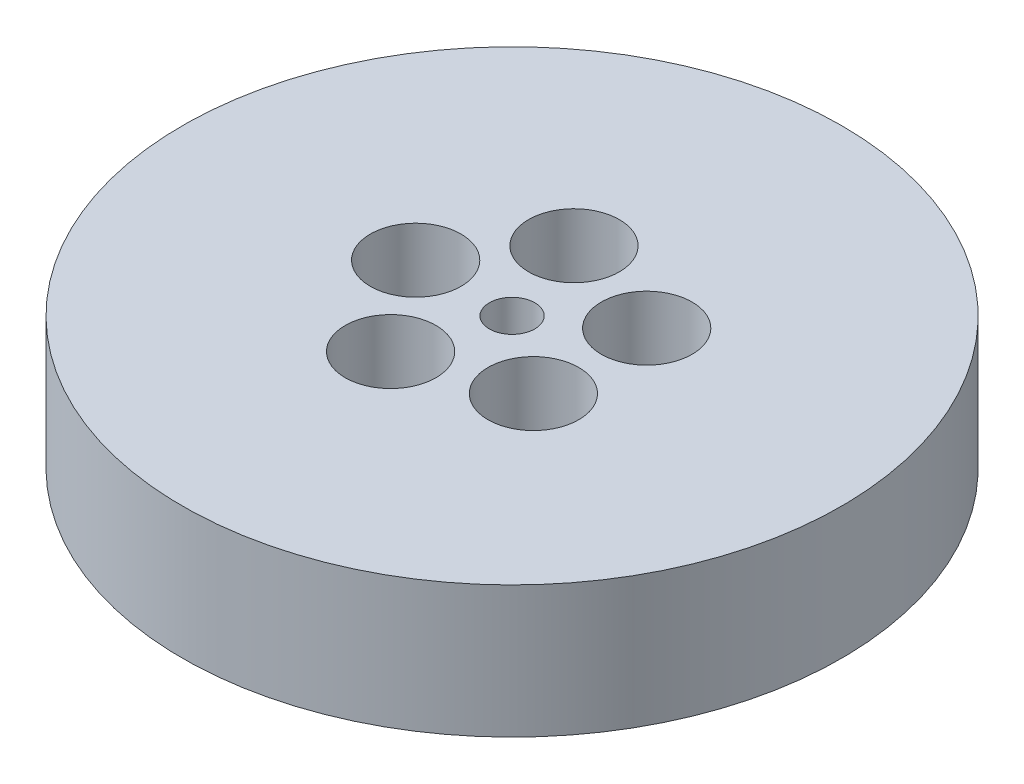
ISO-10303-21;
HEADER;
FILE_DESCRIPTION(('STEP AP214'),'2;1');
FILE_NAME('part.step','',(''),(''),'','','');
FILE_SCHEMA(('AUTOMOTIVE_DESIGN { 1 0 10303 214 1 1 1 1 }'));
ENDSEC;
DATA;
#1=APPLICATION_CONTEXT('core data for automotive mechanical design processes');
#2=APPLICATION_PROTOCOL_DEFINITION('international standard','automotive_design',2000,#1);
#3=PRODUCT_CONTEXT('',#1,'mechanical');
#4=PRODUCT('Part','Part','',(#3));
#5=PRODUCT_RELATED_PRODUCT_CATEGORY('part','',(#4));
#6=PRODUCT_DEFINITION_FORMATION('','',#4);
#7=PRODUCT_DEFINITION_CONTEXT('part definition',#1,'design');
#8=PRODUCT_DEFINITION('design','',#6,#7);
#9=PRODUCT_DEFINITION_SHAPE('','',#8);
#10=(LENGTH_UNIT() NAMED_UNIT(*) SI_UNIT(.MILLI.,.METRE.));
#11=(NAMED_UNIT(*) PLANE_ANGLE_UNIT() SI_UNIT($,.RADIAN.));
#12=(NAMED_UNIT(*) SI_UNIT($,.STERADIAN.) SOLID_ANGLE_UNIT());
#13=UNCERTAINTY_MEASURE_WITH_UNIT(LENGTH_MEASURE(1.E-05),#10,'distance_accuracy_value','');
#14=(GEOMETRIC_REPRESENTATION_CONTEXT(3) GLOBAL_UNCERTAINTY_ASSIGNED_CONTEXT((#13)) GLOBAL_UNIT_ASSIGNED_CONTEXT((#10,
#11,#12)) REPRESENTATION_CONTEXT('',''));
#15=CARTESIAN_POINT('',(0.,0.,0.));
#16=DIRECTION('',(0.,0.,1.));
#17=DIRECTION('',(1.,0.,0.));
#18=AXIS2_PLACEMENT_3D('',#15,#16,#17);
#19=CARTESIAN_POINT('',(0.,29.,0.));
#20=DIRECTION('',(0.,-1.,0.));
#21=DIRECTION('',(0.,0.,-1.));
#22=AXIS2_PLACEMENT_3D('',#19,#20,#21);
#23=CYLINDRICAL_SURFACE('',#22,72.5);
#24=CARTESIAN_POINT('',(0.,29.,0.));
#25=DIRECTION('',(0.,1.,0.));
#26=DIRECTION('',(0.,0.,1.));
#27=AXIS2_PLACEMENT_3D('',#24,#25,#26);
#28=CIRCLE('',#27,72.5);
#29=CARTESIAN_POINT('',(0.,29.,-72.5));
#30=VERTEX_POINT('',#29);
#31=EDGE_CURVE('E10',#30,#30,#28,.T.);
#32=CARTESIAN_POINT('',(0.,0.,0.));
#33=DIRECTION('',(0.,1.,0.));
#34=DIRECTION('',(0.,0.,1.));
#35=AXIS2_PLACEMENT_3D('',#32,#33,#34);
#36=CIRCLE('',#35,72.5);
#37=CARTESIAN_POINT('',(0.,0.,-72.5));
#38=VERTEX_POINT('',#37);
#39=EDGE_CURVE('E37',#38,#38,#36,.T.);
#40=CARTESIAN_POINT('',(0.,29.,-72.5));
#41=CARTESIAN_POINT('',(0.,28.6979166666667,-72.5));
#42=CARTESIAN_POINT('',(0.,28.3958333333333,-72.5));
#43=CARTESIAN_POINT('',(0.,27.7916666666667,-72.5));
#44=CARTESIAN_POINT('',(0.,27.4895833333333,-72.5));
#45=CARTESIAN_POINT('',(0.,26.8854166666667,-72.5));
#46=CARTESIAN_POINT('',(0.,26.5833333333333,-72.5));
#47=CARTESIAN_POINT('',(0.,25.9791666666667,-72.5));
#48=CARTESIAN_POINT('',(0.,25.6770833333333,-72.5));
#49=CARTESIAN_POINT('',(0.,25.0729166666667,-72.5));
#50=CARTESIAN_POINT('',(0.,24.7708333333333,-72.5));
#51=CARTESIAN_POINT('',(0.,24.1666666666667,-72.5));
#52=CARTESIAN_POINT('',(0.,23.8645833333333,-72.5));
#53=CARTESIAN_POINT('',(0.,23.2604166666667,-72.5));
#54=CARTESIAN_POINT('',(0.,22.9583333333333,-72.5));
#55=CARTESIAN_POINT('',(0.,22.3541666666667,-72.5));
#56=CARTESIAN_POINT('',(0.,22.0520833333333,-72.5));
#57=CARTESIAN_POINT('',(0.,21.4479166666667,-72.5));
#58=CARTESIAN_POINT('',(0.,21.1458333333333,-72.5));
#59=CARTESIAN_POINT('',(0.,20.5416666666667,-72.5));
#60=CARTESIAN_POINT('',(0.,20.2395833333333,-72.5));
#61=CARTESIAN_POINT('',(0.,19.6354166666667,-72.5));
#62=CARTESIAN_POINT('',(0.,19.3333333333333,-72.5));
#63=CARTESIAN_POINT('',(0.,18.7291666666667,-72.5));
#64=CARTESIAN_POINT('',(0.,18.4270833333333,-72.5));
#65=CARTESIAN_POINT('',(0.,17.8229166666667,-72.5));
#66=CARTESIAN_POINT('',(0.,17.5208333333333,-72.5));
#67=CARTESIAN_POINT('',(0.,16.9166666666667,-72.5));
#68=CARTESIAN_POINT('',(0.,16.6145833333333,-72.5));
#69=CARTESIAN_POINT('',(0.,16.0104166666667,-72.5));
#70=CARTESIAN_POINT('',(0.,15.7083333333333,-72.5));
#71=CARTESIAN_POINT('',(0.,15.1041666666667,-72.5));
#72=CARTESIAN_POINT('',(0.,14.8020833333333,-72.5));
#73=CARTESIAN_POINT('',(0.,14.1979166666667,-72.5));
#74=CARTESIAN_POINT('',(0.,13.8958333333333,-72.5));
#75=CARTESIAN_POINT('',(0.,13.2916666666667,-72.5));
#76=CARTESIAN_POINT('',(0.,12.9895833333333,-72.5));
#77=CARTESIAN_POINT('',(0.,12.3854166666667,-72.5));
#78=CARTESIAN_POINT('',(0.,12.0833333333333,-72.5));
#79=CARTESIAN_POINT('',(0.,11.4791666666667,-72.5));
#80=CARTESIAN_POINT('',(0.,11.1770833333333,-72.5));
#81=CARTESIAN_POINT('',(0.,10.5729166666667,-72.5));
#82=CARTESIAN_POINT('',(0.,10.2708333333333,-72.5));
#83=CARTESIAN_POINT('',(0.,9.66666666666667,-72.5));
#84=CARTESIAN_POINT('',(0.,9.36458333333333,-72.5));
#85=CARTESIAN_POINT('',(0.,8.76041666666667,-72.5));
#86=CARTESIAN_POINT('',(0.,8.45833333333333,-72.5));
#87=CARTESIAN_POINT('',(0.,7.85416666666667,-72.5));
#88=CARTESIAN_POINT('',(0.,7.55208333333333,-72.5));
#89=CARTESIAN_POINT('',(0.,6.94791666666667,-72.5));
#90=CARTESIAN_POINT('',(0.,6.64583333333333,-72.5));
#91=CARTESIAN_POINT('',(0.,6.04166666666667,-72.5));
#92=CARTESIAN_POINT('',(0.,5.73958333333333,-72.5));
#93=CARTESIAN_POINT('',(0.,5.13541666666667,-72.5));
#94=CARTESIAN_POINT('',(0.,4.83333333333333,-72.5));
#95=CARTESIAN_POINT('',(0.,4.22916666666667,-72.5));
#96=CARTESIAN_POINT('',(0.,3.92708333333333,-72.5));
#97=CARTESIAN_POINT('',(0.,3.32291666666667,-72.5));
#98=CARTESIAN_POINT('',(0.,3.02083333333333,-72.5));
#99=CARTESIAN_POINT('',(0.,2.41666666666667,-72.5));
#100=CARTESIAN_POINT('',(0.,2.11458333333333,-72.5));
#101=CARTESIAN_POINT('',(0.,1.51041666666667,-72.5));
#102=CARTESIAN_POINT('',(0.,1.20833333333333,-72.5));
#103=CARTESIAN_POINT('',(0.,0.604166666666667,-72.5));
#104=CARTESIAN_POINT('',(0.,0.302083333333333,-72.5));
#105=CARTESIAN_POINT('',(0.,0.,-72.5));
#106=B_SPLINE_CURVE_WITH_KNOTS('',3,(#40,#41,#42,#43,#44,#45,#46,#47,#48,#49,#50,#51,#52,#53,
#54,#55,#56,#57,#58,#59,#60,#61,#62,#63,#64,#65,#66,#67,#68,#69,#70,#71,#72,#73,#74,#75,#76,#77,
#78,#79,#80,#81,#82,#83,#84,#85,#86,#87,#88,#89,#90,#91,#92,#93,#94,#95,#96,#97,#98,#99,#100,
#101,#102,#103,#104,#105),.UNSPECIFIED.,.F.,.F.,(4,2,2,2,2,2,2,2,2,2,2,2,2,2,2,2,2,2,2,2,2,2,2,
2,2,2,2,2,2,2,2,2,4),(0.,0.906249999999997,1.8125,2.71875,3.625,4.53125,5.4375,6.34375,7.25,
8.15625,9.0625,9.96875,10.875,11.78125,12.6875,13.59375,14.5,15.40625,16.3125,17.21875,18.125,
19.03125,19.9375,20.84375,21.75,22.65625,23.5625,24.46875,25.375,26.28125,27.1875,28.09375,29.),.UNSPECIFIED.);
#107=EDGE_CURVE('BSEAM40',#30,#38,#106,.T.);
#108=ORIENTED_EDGE('',*,*,#31,.F.);
#109=ORIENTED_EDGE('',*,*,#39,.T.);
#110=ORIENTED_EDGE('',*,*,#107,.T.);
#111=ORIENTED_EDGE('',*,*,#107,.F.);
#112=EDGE_LOOP('',(#108,#110,#109,#111));
#113=FACE_BOUND('',#112,.T.);
#114=ADVANCED_FACE('F40',(#113),#23,.T.);
#115=CARTESIAN_POINT('',(0.,29.,0.));
#116=DIRECTION('',(0.,1.,0.));
#117=DIRECTION('',(0.,0.,1.));
#118=AXIS2_PLACEMENT_3D('',#115,#116,#117);
#119=PLANE('',#118);
#120=CARTESIAN_POINT('',(-6.55273618096701,29.,-20.167248267614));
#121=DIRECTION('',(0.,1.,0.));
#122=DIRECTION('',(-0.95105651629515,0.,0.309016994374958));
#123=AXIS2_PLACEMENT_3D('',#120,#121,#122);
#124=CIRCLE('',#123,9.978301822353);
#125=CARTESIAN_POINT('',(-6.55273618096701,29.,-10.188946445261));
#126=VERTEX_POINT('',#125);
#127=EDGE_CURVE('E70',#126,#126,#124,.T.);
#128=ORIENTED_EDGE('',*,*,#127,.F.);
#129=EDGE_LOOP('',(#128));
#130=FACE_BOUND('',#129,.T.);
#131=CARTESIAN_POINT('',(17.1552860410821,29.,-12.4640448889431));
#132=DIRECTION('',(0.,1.,0.));
#133=DIRECTION('',(-0.58778525229248,0.,-0.809016994374942));
#134=AXIS2_PLACEMENT_3D('',#131,#132,#133);
#135=CIRCLE('',#134,9.978301822353);
#136=CARTESIAN_POINT('',(17.1552860410821,29.,-2.48574306659011));
#137=VERTEX_POINT('',#136);
#138=EDGE_CURVE('E71',#137,#137,#135,.T.);
#139=ORIENTED_EDGE('',*,*,#138,.F.);
#140=EDGE_LOOP('',(#139));
#141=FACE_BOUND('',#140,.T.);
#142=CARTESIAN_POINT('',(17.1552860410823,29.,12.4640448889429));
#143=DIRECTION('',(0.,1.,0.));
#144=DIRECTION('',(0.587785252292469,0.,-0.809016994374951));
#145=AXIS2_PLACEMENT_3D('',#142,#143,#144);
#146=CIRCLE('',#145,9.978301822353);
#147=CARTESIAN_POINT('',(17.1552860410823,29.,22.4423467112959));
#148=VERTEX_POINT('',#147);
#149=EDGE_CURVE('E78',#148,#148,#146,.T.);
#150=ORIENTED_EDGE('',*,*,#149,.F.);
#151=EDGE_LOOP('',(#150));
#152=FACE_BOUND('',#151,.T.);
#153=CARTESIAN_POINT('',(-6.55273618096673,29.,20.1672482676141));
#154=DIRECTION('',(0.,1.,0.));
#155=DIRECTION('',(0.951056516295155,0.,0.309016994374945));
#156=AXIS2_PLACEMENT_3D('',#153,#154,#155);
#157=CIRCLE('',#156,9.978301822353);
#158=CARTESIAN_POINT('',(-6.55273618096673,29.,30.1455500899671));
#159=VERTEX_POINT('',#158);
#160=EDGE_CURVE('E61',#159,#159,#157,.T.);
#161=ORIENTED_EDGE('',*,*,#160,.F.);
#162=EDGE_LOOP('',(#161));
#163=FACE_BOUND('',#162,.T.);
#164=CARTESIAN_POINT('',(-21.2050997202309,29.,0.));
#165=DIRECTION('',(0.,1.,0.));
#166=DIRECTION('',(0.,0.,1.));
#167=AXIS2_PLACEMENT_3D('',#164,#165,#166);
#168=CIRCLE('',#167,9.978301822353);
#169=CARTESIAN_POINT('',(-21.2050997202309,29.,9.978301822353));
#170=VERTEX_POINT('',#169);
#171=EDGE_CURVE('E54',#170,#170,#168,.T.);
#172=ORIENTED_EDGE('',*,*,#171,.F.);
#173=EDGE_LOOP('',(#172));
#174=FACE_BOUND('',#173,.T.);
#175=CARTESIAN_POINT('',(0.,29.,0.));
#176=DIRECTION('',(0.,1.,0.));
#177=DIRECTION('',(0.,0.,1.));
#178=AXIS2_PLACEMENT_3D('',#175,#176,#177);
#179=CIRCLE('',#178,5.);
#180=CARTESIAN_POINT('',(0.,29.,-5.));
#181=VERTEX_POINT('',#180);
#182=EDGE_CURVE('E50',#181,#181,#179,.T.);
#183=ORIENTED_EDGE('',*,*,#182,.F.);
#184=EDGE_LOOP('',(#183));
#185=FACE_BOUND('',#184,.T.);
#186=ORIENTED_EDGE('',*,*,#31,.T.);
#187=EDGE_LOOP('',(#186));
#188=FACE_BOUND('',#187,.T.);
#189=ADVANCED_FACE('F94',(#130,#141,#152,#163,#174,#185,#188),#119,.T.);
#190=CARTESIAN_POINT('',(0.,0.,0.));
#191=DIRECTION('',(0.,1.,0.));
#192=DIRECTION('',(0.,0.,1.));
#193=AXIS2_PLACEMENT_3D('',#190,#191,#192);
#194=PLANE('',#193);
#195=CARTESIAN_POINT('',(0.,0.,0.));
#196=DIRECTION('',(0.,1.,0.));
#197=DIRECTION('',(0.,0.,1.));
#198=AXIS2_PLACEMENT_3D('',#195,#196,#197);
#199=CIRCLE('',#198,5.);
#200=CARTESIAN_POINT('',(0.,0.,-5.));
#201=VERTEX_POINT('',#200);
#202=EDGE_CURVE('E47',#201,#201,#199,.T.);
#203=ORIENTED_EDGE('',*,*,#202,.T.);
#204=EDGE_LOOP('',(#203));
#205=FACE_BOUND('',#204,.T.);
#206=ORIENTED_EDGE('',*,*,#39,.F.);
#207=EDGE_LOOP('',(#206));
#208=FACE_BOUND('',#207,.T.);
#209=ADVANCED_FACE('F100',(#205,#208),#194,.F.);
#210=CARTESIAN_POINT('',(0.,29.,0.));
#211=DIRECTION('',(0.,-1.,0.));
#212=DIRECTION('',(0.,0.,-1.));
#213=AXIS2_PLACEMENT_3D('',#210,#211,#212);
#214=CYLINDRICAL_SURFACE('',#213,5.);
#215=CARTESIAN_POINT('',(0.,29.,-5.));
#216=CARTESIAN_POINT('',(0.,28.6979166666667,-5.));
#217=CARTESIAN_POINT('',(0.,28.3958333333333,-5.));
#218=CARTESIAN_POINT('',(0.,27.7916666666667,-5.));
#219=CARTESIAN_POINT('',(0.,27.4895833333333,-5.));
#220=CARTESIAN_POINT('',(0.,26.8854166666667,-5.));
#221=CARTESIAN_POINT('',(0.,26.5833333333333,-5.));
#222=CARTESIAN_POINT('',(0.,25.9791666666667,-5.));
#223=CARTESIAN_POINT('',(0.,25.6770833333333,-5.));
#224=CARTESIAN_POINT('',(0.,25.0729166666667,-5.));
#225=CARTESIAN_POINT('',(0.,24.7708333333333,-5.));
#226=CARTESIAN_POINT('',(0.,24.1666666666667,-5.));
#227=CARTESIAN_POINT('',(0.,23.8645833333333,-5.));
#228=CARTESIAN_POINT('',(0.,23.2604166666667,-5.));
#229=CARTESIAN_POINT('',(0.,22.9583333333333,-5.));
#230=CARTESIAN_POINT('',(0.,22.3541666666667,-5.));
#231=CARTESIAN_POINT('',(0.,22.0520833333333,-5.));
#232=CARTESIAN_POINT('',(0.,21.4479166666667,-5.));
#233=CARTESIAN_POINT('',(0.,21.1458333333333,-5.));
#234=CARTESIAN_POINT('',(0.,20.5416666666667,-5.));
#235=CARTESIAN_POINT('',(0.,20.2395833333333,-5.));
#236=CARTESIAN_POINT('',(0.,19.6354166666667,-5.));
#237=CARTESIAN_POINT('',(0.,19.3333333333333,-5.));
#238=CARTESIAN_POINT('',(0.,18.7291666666667,-5.));
#239=CARTESIAN_POINT('',(0.,18.4270833333333,-5.));
#240=CARTESIAN_POINT('',(0.,17.8229166666667,-5.));
#241=CARTESIAN_POINT('',(0.,17.5208333333333,-5.));
#242=CARTESIAN_POINT('',(0.,16.9166666666667,-5.));
#243=CARTESIAN_POINT('',(0.,16.6145833333333,-5.));
#244=CARTESIAN_POINT('',(0.,16.0104166666667,-5.));
#245=CARTESIAN_POINT('',(0.,15.7083333333333,-5.));
#246=CARTESIAN_POINT('',(0.,15.1041666666667,-5.));
#247=CARTESIAN_POINT('',(0.,14.8020833333333,-5.));
#248=CARTESIAN_POINT('',(0.,14.1979166666667,-5.));
#249=CARTESIAN_POINT('',(0.,13.8958333333333,-5.));
#250=CARTESIAN_POINT('',(0.,13.2916666666667,-5.));
#251=CARTESIAN_POINT('',(0.,12.9895833333333,-5.));
#252=CARTESIAN_POINT('',(0.,12.3854166666667,-5.));
#253=CARTESIAN_POINT('',(0.,12.0833333333333,-5.));
#254=CARTESIAN_POINT('',(0.,11.4791666666667,-5.));
#255=CARTESIAN_POINT('',(0.,11.1770833333333,-5.));
#256=CARTESIAN_POINT('',(0.,10.5729166666667,-5.));
#257=CARTESIAN_POINT('',(0.,10.2708333333333,-5.));
#258=CARTESIAN_POINT('',(0.,9.66666666666667,-5.));
#259=CARTESIAN_POINT('',(0.,9.36458333333333,-5.));
#260=CARTESIAN_POINT('',(0.,8.76041666666667,-5.));
#261=CARTESIAN_POINT('',(0.,8.45833333333333,-5.));
#262=CARTESIAN_POINT('',(0.,7.85416666666667,-5.));
#263=CARTESIAN_POINT('',(0.,7.55208333333333,-5.));
#264=CARTESIAN_POINT('',(0.,6.94791666666667,-5.));
#265=CARTESIAN_POINT('',(0.,6.64583333333333,-5.));
#266=CARTESIAN_POINT('',(0.,6.04166666666667,-5.));
#267=CARTESIAN_POINT('',(0.,5.73958333333333,-5.));
#268=CARTESIAN_POINT('',(0.,5.13541666666667,-5.));
#269=CARTESIAN_POINT('',(0.,4.83333333333333,-5.));
#270=CARTESIAN_POINT('',(0.,4.22916666666667,-5.));
#271=CARTESIAN_POINT('',(0.,3.92708333333333,-5.));
#272=CARTESIAN_POINT('',(0.,3.32291666666667,-5.));
#273=CARTESIAN_POINT('',(0.,3.02083333333333,-5.));
#274=CARTESIAN_POINT('',(0.,2.41666666666667,-5.));
#275=CARTESIAN_POINT('',(0.,2.11458333333333,-5.));
#276=CARTESIAN_POINT('',(0.,1.51041666666667,-5.));
#277=CARTESIAN_POINT('',(0.,1.20833333333333,-5.));
#278=CARTESIAN_POINT('',(0.,0.604166666666667,-5.));
#279=CARTESIAN_POINT('',(0.,0.302083333333333,-5.));
#280=CARTESIAN_POINT('',(0.,0.,-5.));
#281=B_SPLINE_CURVE_WITH_KNOTS('',3,(#215,#216,#217,#218,#219,#220,#221,#222,#223,#224,#225,
#226,#227,#228,#229,#230,#231,#232,#233,#234,#235,#236,#237,#238,#239,#240,#241,#242,#243,#244,
#245,#246,#247,#248,#249,#250,#251,#252,#253,#254,#255,#256,#257,#258,#259,#260,#261,#262,#263,
#264,#265,#266,#267,#268,#269,#270,#271,#272,#273,#274,#275,#276,#277,#278,#279,#280),
.UNSPECIFIED.,.F.,.F.,(4,2,2,2,2,2,2,2,2,2,2,2,2,2,2,2,2,2,2,2,2,2,2,2,2,2,2,2,2,2,2,2,4),(0.,
0.906249999999997,1.8125,2.71875,3.625,4.53125,5.4375,6.34375,7.25,8.15625,9.0625,9.96875,
10.875,11.78125,12.6875,13.59375,14.5,15.40625,16.3125,17.21875,18.125,19.03125,19.9375,
20.84375,21.75,22.65625,23.5625,24.46875,25.375,26.28125,27.1875,28.09375,29.),.UNSPECIFIED.);
#282=EDGE_CURVE('BSEAM106',#181,#201,#281,.T.);
#283=ORIENTED_EDGE('',*,*,#182,.T.);
#284=ORIENTED_EDGE('',*,*,#202,.F.);
#285=ORIENTED_EDGE('',*,*,#282,.T.);
#286=ORIENTED_EDGE('',*,*,#282,.F.);
#287=EDGE_LOOP('',(#283,#285,#284,#286));
#288=FACE_BOUND('',#287,.T.);
#289=ADVANCED_FACE('F106',(#288),#214,.F.);
#290=CARTESIAN_POINT('',(-21.2050997202309,0.403029077135825,0.));
#291=DIRECTION('',(0.,1.,0.));
#292=DIRECTION('',(0.,0.,1.));
#293=AXIS2_PLACEMENT_3D('',#290,#291,#292);
#294=CYLINDRICAL_SURFACE('',#293,9.978301822353);
#295=CARTESIAN_POINT('',(-21.2050997202309,0.403029077135825,0.));
#296=DIRECTION('',(0.,1.,0.));
#297=DIRECTION('',(0.,0.,1.));
#298=AXIS2_PLACEMENT_3D('',#295,#296,#297);
#299=CIRCLE('',#298,9.978301822353);
#300=CARTESIAN_POINT('',(-21.2050997202309,0.403029077135825,9.978301822353));
#301=VERTEX_POINT('',#300);
#302=EDGE_CURVE('E55',#301,#301,#299,.T.);
#303=CARTESIAN_POINT('',(-21.2050997202309,0.403029077135825,9.978301822353));
#304=CARTESIAN_POINT('',(-21.2050997202309,0.70091419091566,9.978301822353));
#305=CARTESIAN_POINT('',(-21.2050997202309,0.998799304695495,9.978301822353));
#306=CARTESIAN_POINT('',(-21.2050997202309,1.59456953225517,9.978301822353));
#307=CARTESIAN_POINT('',(-21.2050997202309,1.892454646035,9.978301822353));
#308=CARTESIAN_POINT('',(-21.2050997202309,2.48822487359467,9.978301822353));
#309=CARTESIAN_POINT('',(-21.2050997202309,2.78610998737451,9.978301822353));
#310=CARTESIAN_POINT('',(-21.2050997202309,3.38188021493418,9.978301822353));
#311=CARTESIAN_POINT('',(-21.2050997202309,3.67976532871401,9.978301822353));
#312=CARTESIAN_POINT('',(-21.2050997202309,4.27553555627368,9.978301822353));
#313=CARTESIAN_POINT('',(-21.2050997202309,4.57342067005352,9.978301822353));
#314=CARTESIAN_POINT('',(-21.2050997202309,5.16919089761319,9.978301822353));
#315=CARTESIAN_POINT('',(-21.2050997202309,5.46707601139302,9.978301822353));
#316=CARTESIAN_POINT('',(-21.2050997202309,6.06284623895269,9.978301822353));
#317=CARTESIAN_POINT('',(-21.2050997202309,6.36073135273253,9.978301822353));
#318=CARTESIAN_POINT('',(-21.2050997202309,6.9565015802922,9.978301822353));
#319=CARTESIAN_POINT('',(-21.2050997202309,7.25438669407203,9.978301822353));
#320=CARTESIAN_POINT('',(-21.2050997202309,7.8501569216317,9.978301822353));
#321=CARTESIAN_POINT('',(-21.2050997202309,8.14804203541154,9.978301822353));
#322=CARTESIAN_POINT('',(-21.2050997202309,8.74381226297121,9.978301822353));
#323=CARTESIAN_POINT('',(-21.2050997202309,9.04169737675104,9.978301822353));
#324=CARTESIAN_POINT('',(-21.2050997202309,9.63746760431071,9.978301822353));
#325=CARTESIAN_POINT('',(-21.2050997202309,9.93535271809055,9.978301822353));
#326=CARTESIAN_POINT('',(-21.2050997202309,10.5311229456502,9.978301822353));
#327=CARTESIAN_POINT('',(-21.2050997202309,10.8290080594301,9.978301822353));
#328=CARTESIAN_POINT('',(-21.2050997202309,11.4247782869897,9.978301822353));
#329=CARTESIAN_POINT('',(-21.2050997202309,11.7226634007696,9.978301822353));
#330=CARTESIAN_POINT('',(-21.2050997202309,12.3184336283292,9.978301822353));
#331=CARTESIAN_POINT('',(-21.2050997202309,12.6163187421091,9.978301822353));
#332=CARTESIAN_POINT('',(-21.2050997202309,13.2120889696687,9.978301822353));
#333=CARTESIAN_POINT('',(-21.2050997202309,13.5099740834486,9.978301822353));
#334=CARTESIAN_POINT('',(-21.2050997202309,14.1057443110082,9.978301822353));
#335=CARTESIAN_POINT('',(-21.2050997202309,14.4036294247881,9.978301822353));
#336=CARTESIAN_POINT('',(-21.2050997202309,14.9993996523477,9.978301822353));
#337=CARTESIAN_POINT('',(-21.2050997202309,15.2972847661276,9.978301822353));
#338=CARTESIAN_POINT('',(-21.2050997202309,15.8930549936873,9.978301822353));
#339=CARTESIAN_POINT('',(-21.2050997202309,16.1909401074671,9.978301822353));
#340=CARTESIAN_POINT('',(-21.2050997202309,16.7867103350268,9.978301822353));
#341=CARTESIAN_POINT('',(-21.2050997202309,17.0845954488066,9.978301822353));
#342=CARTESIAN_POINT('',(-21.2050997202309,17.6803656763663,9.978301822353));
#343=CARTESIAN_POINT('',(-21.2050997202309,17.9782507901461,9.978301822353));
#344=CARTESIAN_POINT('',(-21.2050997202309,18.5740210177058,9.978301822353));
#345=CARTESIAN_POINT('',(-21.2050997202309,18.8719061314856,9.978301822353));
#346=CARTESIAN_POINT('',(-21.2050997202309,19.4676763590453,9.978301822353));
#347=CARTESIAN_POINT('',(-21.2050997202309,19.7655614728251,9.978301822353));
#348=CARTESIAN_POINT('',(-21.2050997202309,20.3613317003848,9.978301822353));
#349=CARTESIAN_POINT('',(-21.2050997202309,20.6592168141646,9.978301822353));
#350=CARTESIAN_POINT('',(-21.2050997202309,21.2549870417243,9.978301822353));
#351=CARTESIAN_POINT('',(-21.2050997202309,21.5528721555041,9.978301822353));
#352=CARTESIAN_POINT('',(-21.2050997202309,22.1486423830638,9.978301822353));
#353=CARTESIAN_POINT('',(-21.2050997202309,22.4465274968436,9.978301822353));
#354=CARTESIAN_POINT('',(-21.2050997202309,23.0422977244033,9.978301822353));
#355=CARTESIAN_POINT('',(-21.2050997202309,23.3401828381831,9.978301822353));
#356=CARTESIAN_POINT('',(-21.2050997202309,23.9359530657428,9.978301822353));
#357=CARTESIAN_POINT('',(-21.2050997202309,24.2338381795226,9.978301822353));
#358=CARTESIAN_POINT('',(-21.2050997202309,24.8296084070823,9.978301822353));
#359=CARTESIAN_POINT('',(-21.2050997202309,25.1274935208621,9.978301822353));
#360=CARTESIAN_POINT('',(-21.2050997202309,25.7232637484218,9.978301822353));
#361=CARTESIAN_POINT('',(-21.2050997202309,26.0211488622017,9.978301822353));
#362=CARTESIAN_POINT('',(-21.2050997202309,26.6169190897613,9.978301822353));
#363=CARTESIAN_POINT('',(-21.2050997202309,26.9148042035412,9.978301822353));
#364=CARTESIAN_POINT('',(-21.2050997202309,27.5105744311008,9.978301822353));
#365=CARTESIAN_POINT('',(-21.2050997202309,27.8084595448807,9.978301822353));
#366=CARTESIAN_POINT('',(-21.2050997202309,28.4042297724403,9.978301822353));
#367=CARTESIAN_POINT('',(-21.2050997202309,28.7021148862202,9.978301822353));
#368=CARTESIAN_POINT('',(-21.2050997202309,29.,9.978301822353));
#369=B_SPLINE_CURVE_WITH_KNOTS('',3,(#303,#304,#305,#306,#307,#308,#309,#310,#311,#312,#313,
#314,#315,#316,#317,#318,#319,#320,#321,#322,#323,#324,#325,#326,#327,#328,#329,#330,#331,#332,
#333,#334,#335,#336,#337,#338,#339,#340,#341,#342,#343,#344,#345,#346,#347,#348,#349,#350,#351,
#352,#353,#354,#355,#356,#357,#358,#359,#360,#361,#362,#363,#364,#365,#366,#367,#368),
.UNSPECIFIED.,.F.,.F.,(4,2,2,2,2,2,2,2,2,2,2,2,2,2,2,2,2,2,2,2,2,2,2,2,2,2,2,2,2,2,2,2,4),(0.,
0.893655341339505,1.78731068267901,2.68096602401852,3.57462136535802,4.46827670669753,
5.36193204803703,6.25558738937654,7.14924273071604,8.04289807205555,8.93655341339505,
9.83020875473456,10.7238640960741,11.6175194374136,12.5111747787531,13.4048301200926,
14.2984854614321,15.1921408027716,16.0857961441111,16.9794514854506,17.8731068267901,
18.7667621681296,19.6604175094691,20.5540728508086,21.4477281921481,22.3413835334876,
23.2350388748271,24.1286942161667,25.0223495575062,25.9160048988457,26.8096602401852,
27.7033155815247,28.5969709228642),.UNSPECIFIED.);
#370=EDGE_CURVE('BSEAM108',#301,#170,#369,.T.);
#371=ORIENTED_EDGE('',*,*,#302,.F.);
#372=ORIENTED_EDGE('',*,*,#171,.T.);
#373=ORIENTED_EDGE('',*,*,#370,.T.);
#374=ORIENTED_EDGE('',*,*,#370,.F.);
#375=EDGE_LOOP('',(#371,#373,#372,#374));
#376=FACE_BOUND('',#375,.T.);
#377=ADVANCED_FACE('F108',(#376),#294,.F.);
#378=CARTESIAN_POINT('',(-21.2050997202309,0.403029077135825,0.));
#379=DIRECTION('',(0.,1.,0.));
#380=DIRECTION('',(0.,0.,1.));
#381=AXIS2_PLACEMENT_3D('',#378,#379,#380);
#382=PLANE('',#381);
#383=ORIENTED_EDGE('',*,*,#302,.T.);
#384=EDGE_LOOP('',(#383));
#385=FACE_BOUND('',#384,.T.);
#386=ADVANCED_FACE('F138',(#385),#382,.T.);
#387=CARTESIAN_POINT('',(-6.55273618096673,0.403029077135825,20.1672482676141));
#388=DIRECTION('',(0.,1.,0.));
#389=DIRECTION('',(0.,0.,1.));
#390=AXIS2_PLACEMENT_3D('',#387,#388,#389);
#391=CYLINDRICAL_SURFACE('',#390,9.978301822353);
#392=CARTESIAN_POINT('',(-6.55273618096673,0.403029077135825,20.1672482676141));
#393=DIRECTION('',(0.,1.,0.));
#394=DIRECTION('',(0.951056516295155,0.,0.309016994374945));
#395=AXIS2_PLACEMENT_3D('',#392,#393,#394);
#396=CIRCLE('',#395,9.978301822353);
#397=CARTESIAN_POINT('',(-6.55273618096673,0.403029077135825,30.1455500899671));
#398=VERTEX_POINT('',#397);
#399=EDGE_CURVE('E59',#398,#398,#396,.T.);
#400=CARTESIAN_POINT('',(-6.55273618096673,0.403029077135825,30.1455500899671));
#401=CARTESIAN_POINT('',(-6.55273618096673,0.70091419091566,30.1455500899671));
#402=CARTESIAN_POINT('',(-6.55273618096673,0.998799304695495,30.1455500899671));
#403=CARTESIAN_POINT('',(-6.55273618096673,1.59456953225517,30.1455500899671));
#404=CARTESIAN_POINT('',(-6.55273618096673,1.892454646035,30.1455500899671));
#405=CARTESIAN_POINT('',(-6.55273618096673,2.48822487359467,30.1455500899671));
#406=CARTESIAN_POINT('',(-6.55273618096673,2.78610998737451,30.1455500899671));
#407=CARTESIAN_POINT('',(-6.55273618096673,3.38188021493418,30.1455500899671));
#408=CARTESIAN_POINT('',(-6.55273618096673,3.67976532871401,30.1455500899671));
#409=CARTESIAN_POINT('',(-6.55273618096673,4.27553555627368,30.1455500899671));
#410=CARTESIAN_POINT('',(-6.55273618096673,4.57342067005352,30.1455500899671));
#411=CARTESIAN_POINT('',(-6.55273618096673,5.16919089761319,30.1455500899671));
#412=CARTESIAN_POINT('',(-6.55273618096673,5.46707601139302,30.1455500899671));
#413=CARTESIAN_POINT('',(-6.55273618096673,6.06284623895269,30.1455500899671));
#414=CARTESIAN_POINT('',(-6.55273618096673,6.36073135273253,30.1455500899671));
#415=CARTESIAN_POINT('',(-6.55273618096673,6.9565015802922,30.1455500899671));
#416=CARTESIAN_POINT('',(-6.55273618096673,7.25438669407203,30.1455500899671));
#417=CARTESIAN_POINT('',(-6.55273618096673,7.8501569216317,30.1455500899671));
#418=CARTESIAN_POINT('',(-6.55273618096673,8.14804203541154,30.1455500899671));
#419=CARTESIAN_POINT('',(-6.55273618096673,8.74381226297121,30.1455500899671));
#420=CARTESIAN_POINT('',(-6.55273618096673,9.04169737675104,30.1455500899671));
#421=CARTESIAN_POINT('',(-6.55273618096673,9.63746760431071,30.1455500899671));
#422=CARTESIAN_POINT('',(-6.55273618096673,9.93535271809055,30.1455500899671));
#423=CARTESIAN_POINT('',(-6.55273618096673,10.5311229456502,30.1455500899671));
#424=CARTESIAN_POINT('',(-6.55273618096673,10.8290080594301,30.1455500899671));
#425=CARTESIAN_POINT('',(-6.55273618096673,11.4247782869897,30.1455500899671));
#426=CARTESIAN_POINT('',(-6.55273618096673,11.7226634007696,30.1455500899671));
#427=CARTESIAN_POINT('',(-6.55273618096673,12.3184336283292,30.1455500899671));
#428=CARTESIAN_POINT('',(-6.55273618096673,12.6163187421091,30.1455500899671));
#429=CARTESIAN_POINT('',(-6.55273618096673,13.2120889696687,30.1455500899671));
#430=CARTESIAN_POINT('',(-6.55273618096673,13.5099740834486,30.1455500899671));
#431=CARTESIAN_POINT('',(-6.55273618096673,14.1057443110082,30.1455500899671));
#432=CARTESIAN_POINT('',(-6.55273618096673,14.4036294247881,30.1455500899671));
#433=CARTESIAN_POINT('',(-6.55273618096673,14.9993996523477,30.1455500899671));
#434=CARTESIAN_POINT('',(-6.55273618096673,15.2972847661276,30.1455500899671));
#435=CARTESIAN_POINT('',(-6.55273618096673,15.8930549936873,30.1455500899671));
#436=CARTESIAN_POINT('',(-6.55273618096673,16.1909401074671,30.1455500899671));
#437=CARTESIAN_POINT('',(-6.55273618096673,16.7867103350268,30.1455500899671));
#438=CARTESIAN_POINT('',(-6.55273618096673,17.0845954488066,30.1455500899671));
#439=CARTESIAN_POINT('',(-6.55273618096673,17.6803656763663,30.1455500899671));
#440=CARTESIAN_POINT('',(-6.55273618096673,17.9782507901461,30.1455500899671));
#441=CARTESIAN_POINT('',(-6.55273618096673,18.5740210177058,30.1455500899671));
#442=CARTESIAN_POINT('',(-6.55273618096673,18.8719061314856,30.1455500899671));
#443=CARTESIAN_POINT('',(-6.55273618096673,19.4676763590453,30.1455500899671));
#444=CARTESIAN_POINT('',(-6.55273618096673,19.7655614728251,30.1455500899671));
#445=CARTESIAN_POINT('',(-6.55273618096673,20.3613317003848,30.1455500899671));
#446=CARTESIAN_POINT('',(-6.55273618096673,20.6592168141646,30.1455500899671));
#447=CARTESIAN_POINT('',(-6.55273618096673,21.2549870417243,30.1455500899671));
#448=CARTESIAN_POINT('',(-6.55273618096673,21.5528721555041,30.1455500899671));
#449=CARTESIAN_POINT('',(-6.55273618096673,22.1486423830638,30.1455500899671));
#450=CARTESIAN_POINT('',(-6.55273618096673,22.4465274968436,30.1455500899671));
#451=CARTESIAN_POINT('',(-6.55273618096673,23.0422977244033,30.1455500899671));
#452=CARTESIAN_POINT('',(-6.55273618096673,23.3401828381831,30.1455500899671));
#453=CARTESIAN_POINT('',(-6.55273618096673,23.9359530657428,30.1455500899671));
#454=CARTESIAN_POINT('',(-6.55273618096673,24.2338381795226,30.1455500899671));
#455=CARTESIAN_POINT('',(-6.55273618096673,24.8296084070823,30.1455500899671));
#456=CARTESIAN_POINT('',(-6.55273618096673,25.1274935208621,30.1455500899671));
#457=CARTESIAN_POINT('',(-6.55273618096673,25.7232637484218,30.1455500899671));
#458=CARTESIAN_POINT('',(-6.55273618096673,26.0211488622017,30.1455500899671));
#459=CARTESIAN_POINT('',(-6.55273618096673,26.6169190897613,30.1455500899671));
#460=CARTESIAN_POINT('',(-6.55273618096673,26.9148042035412,30.1455500899671));
#461=CARTESIAN_POINT('',(-6.55273618096673,27.5105744311008,30.1455500899671));
#462=CARTESIAN_POINT('',(-6.55273618096673,27.8084595448807,30.1455500899671));
#463=CARTESIAN_POINT('',(-6.55273618096673,28.4042297724403,30.1455500899671));
#464=CARTESIAN_POINT('',(-6.55273618096673,28.7021148862202,30.1455500899671));
#465=CARTESIAN_POINT('',(-6.55273618096673,29.,30.1455500899671));
#466=B_SPLINE_CURVE_WITH_KNOTS('',3,(#400,#401,#402,#403,#404,#405,#406,#407,#408,#409,#410,
#411,#412,#413,#414,#415,#416,#417,#418,#419,#420,#421,#422,#423,#424,#425,#426,#427,#428,#429,
#430,#431,#432,#433,#434,#435,#436,#437,#438,#439,#440,#441,#442,#443,#444,#445,#446,#447,#448,
#449,#450,#451,#452,#453,#454,#455,#456,#457,#458,#459,#460,#461,#462,#463,#464,#465),
.UNSPECIFIED.,.F.,.F.,(4,2,2,2,2,2,2,2,2,2,2,2,2,2,2,2,2,2,2,2,2,2,2,2,2,2,2,2,2,2,2,2,4),(0.,
0.893655341339505,1.78731068267901,2.68096602401852,3.57462136535802,4.46827670669753,
5.36193204803703,6.25558738937654,7.14924273071604,8.04289807205555,8.93655341339505,
9.83020875473456,10.7238640960741,11.6175194374136,12.5111747787531,13.4048301200926,
14.2984854614321,15.1921408027716,16.0857961441111,16.9794514854506,17.8731068267901,
18.7667621681296,19.6604175094691,20.5540728508086,21.4477281921481,22.3413835334876,
23.2350388748271,24.1286942161667,25.0223495575062,25.9160048988457,26.8096602401852,
27.7033155815247,28.5969709228642),.UNSPECIFIED.);
#467=EDGE_CURVE('BSEAM150',#398,#159,#466,.T.);
#468=ORIENTED_EDGE('',*,*,#399,.F.);
#469=ORIENTED_EDGE('',*,*,#160,.T.);
#470=ORIENTED_EDGE('',*,*,#467,.T.);
#471=ORIENTED_EDGE('',*,*,#467,.F.);
#472=EDGE_LOOP('',(#468,#470,#469,#471));
#473=FACE_BOUND('',#472,.T.);
#474=ADVANCED_FACE('F150',(#473),#391,.F.);
#475=CARTESIAN_POINT('',(-6.55273618096673,0.403029077135825,20.1672482676141));
#476=DIRECTION('',(0.,1.,0.));
#477=DIRECTION('',(0.951056516295155,0.,0.309016994374945));
#478=AXIS2_PLACEMENT_3D('',#475,#476,#477);
#479=PLANE('',#478);
#480=ORIENTED_EDGE('',*,*,#399,.T.);
#481=EDGE_LOOP('',(#480));
#482=FACE_BOUND('',#481,.T.);
#483=ADVANCED_FACE('F89',(#482),#479,.T.);
#484=CARTESIAN_POINT('',(17.1552860410823,0.403029077135825,12.4640448889429));
#485=DIRECTION('',(0.,1.,0.));
#486=DIRECTION('',(0.,0.,1.));
#487=AXIS2_PLACEMENT_3D('',#484,#485,#486);
#488=CYLINDRICAL_SURFACE('',#487,9.978301822353);
#489=CARTESIAN_POINT('',(17.1552860410823,0.403029077135825,12.4640448889429));
#490=DIRECTION('',(0.,1.,0.));
#491=DIRECTION('',(0.587785252292469,0.,-0.809016994374951));
#492=AXIS2_PLACEMENT_3D('',#489,#490,#491);
#493=CIRCLE('',#492,9.978301822353);
#494=CARTESIAN_POINT('',(17.1552860410823,0.403029077135825,22.4423467112959));
#495=VERTEX_POINT('',#494);
#496=EDGE_CURVE('E63',#495,#495,#493,.T.);
#497=CARTESIAN_POINT('',(17.1552860410823,0.403029077135825,22.4423467112959));
#498=CARTESIAN_POINT('',(17.1552860410823,0.70091419091566,22.4423467112959));
#499=CARTESIAN_POINT('',(17.1552860410823,0.998799304695495,22.4423467112959));
#500=CARTESIAN_POINT('',(17.1552860410823,1.59456953225517,22.4423467112959));
#501=CARTESIAN_POINT('',(17.1552860410823,1.892454646035,22.4423467112959));
#502=CARTESIAN_POINT('',(17.1552860410823,2.48822487359467,22.4423467112959));
#503=CARTESIAN_POINT('',(17.1552860410823,2.78610998737451,22.4423467112959));
#504=CARTESIAN_POINT('',(17.1552860410823,3.38188021493418,22.4423467112959));
#505=CARTESIAN_POINT('',(17.1552860410823,3.67976532871401,22.4423467112959));
#506=CARTESIAN_POINT('',(17.1552860410823,4.27553555627368,22.4423467112959));
#507=CARTESIAN_POINT('',(17.1552860410823,4.57342067005352,22.4423467112959));
#508=CARTESIAN_POINT('',(17.1552860410823,5.16919089761319,22.4423467112959));
#509=CARTESIAN_POINT('',(17.1552860410823,5.46707601139302,22.4423467112959));
#510=CARTESIAN_POINT('',(17.1552860410823,6.06284623895269,22.4423467112959));
#511=CARTESIAN_POINT('',(17.1552860410823,6.36073135273253,22.4423467112959));
#512=CARTESIAN_POINT('',(17.1552860410823,6.9565015802922,22.4423467112959));
#513=CARTESIAN_POINT('',(17.1552860410823,7.25438669407203,22.4423467112959));
#514=CARTESIAN_POINT('',(17.1552860410823,7.8501569216317,22.4423467112959));
#515=CARTESIAN_POINT('',(17.1552860410823,8.14804203541154,22.4423467112959));
#516=CARTESIAN_POINT('',(17.1552860410823,8.74381226297121,22.4423467112959));
#517=CARTESIAN_POINT('',(17.1552860410823,9.04169737675104,22.4423467112959));
#518=CARTESIAN_POINT('',(17.1552860410823,9.63746760431071,22.4423467112959));
#519=CARTESIAN_POINT('',(17.1552860410823,9.93535271809055,22.4423467112959));
#520=CARTESIAN_POINT('',(17.1552860410823,10.5311229456502,22.4423467112959));
#521=CARTESIAN_POINT('',(17.1552860410823,10.8290080594301,22.4423467112959));
#522=CARTESIAN_POINT('',(17.1552860410823,11.4247782869897,22.4423467112959));
#523=CARTESIAN_POINT('',(17.1552860410823,11.7226634007696,22.4423467112959));
#524=CARTESIAN_POINT('',(17.1552860410823,12.3184336283292,22.4423467112959));
#525=CARTESIAN_POINT('',(17.1552860410823,12.6163187421091,22.4423467112959));
#526=CARTESIAN_POINT('',(17.1552860410823,13.2120889696687,22.4423467112959));
#527=CARTESIAN_POINT('',(17.1552860410823,13.5099740834486,22.4423467112959));
#528=CARTESIAN_POINT('',(17.1552860410823,14.1057443110082,22.4423467112959));
#529=CARTESIAN_POINT('',(17.1552860410823,14.4036294247881,22.4423467112959));
#530=CARTESIAN_POINT('',(17.1552860410823,14.9993996523477,22.4423467112959));
#531=CARTESIAN_POINT('',(17.1552860410823,15.2972847661276,22.4423467112959));
#532=CARTESIAN_POINT('',(17.1552860410823,15.8930549936873,22.4423467112959));
#533=CARTESIAN_POINT('',(17.1552860410823,16.1909401074671,22.4423467112959));
#534=CARTESIAN_POINT('',(17.1552860410823,16.7867103350268,22.4423467112959));
#535=CARTESIAN_POINT('',(17.1552860410823,17.0845954488066,22.4423467112959));
#536=CARTESIAN_POINT('',(17.1552860410823,17.6803656763663,22.4423467112959));
#537=CARTESIAN_POINT('',(17.1552860410823,17.9782507901461,22.4423467112959));
#538=CARTESIAN_POINT('',(17.1552860410823,18.5740210177058,22.4423467112959));
#539=CARTESIAN_POINT('',(17.1552860410823,18.8719061314856,22.4423467112959));
#540=CARTESIAN_POINT('',(17.1552860410823,19.4676763590453,22.4423467112959));
#541=CARTESIAN_POINT('',(17.1552860410823,19.7655614728251,22.4423467112959));
#542=CARTESIAN_POINT('',(17.1552860410823,20.3613317003848,22.4423467112959));
#543=CARTESIAN_POINT('',(17.1552860410823,20.6592168141646,22.4423467112959));
#544=CARTESIAN_POINT('',(17.1552860410823,21.2549870417243,22.4423467112959));
#545=CARTESIAN_POINT('',(17.1552860410823,21.5528721555041,22.4423467112959));
#546=CARTESIAN_POINT('',(17.1552860410823,22.1486423830638,22.4423467112959));
#547=CARTESIAN_POINT('',(17.1552860410823,22.4465274968436,22.4423467112959));
#548=CARTESIAN_POINT('',(17.1552860410823,23.0422977244033,22.4423467112959));
#549=CARTESIAN_POINT('',(17.1552860410823,23.3401828381831,22.4423467112959));
#550=CARTESIAN_POINT('',(17.1552860410823,23.9359530657428,22.4423467112959));
#551=CARTESIAN_POINT('',(17.1552860410823,24.2338381795226,22.4423467112959));
#552=CARTESIAN_POINT('',(17.1552860410823,24.8296084070823,22.4423467112959));
#553=CARTESIAN_POINT('',(17.1552860410823,25.1274935208621,22.4423467112959));
#554=CARTESIAN_POINT('',(17.1552860410823,25.7232637484218,22.4423467112959));
#555=CARTESIAN_POINT('',(17.1552860410823,26.0211488622017,22.4423467112959));
#556=CARTESIAN_POINT('',(17.1552860410823,26.6169190897613,22.4423467112959));
#557=CARTESIAN_POINT('',(17.1552860410823,26.9148042035412,22.4423467112959));
#558=CARTESIAN_POINT('',(17.1552860410823,27.5105744311008,22.4423467112959));
#559=CARTESIAN_POINT('',(17.1552860410823,27.8084595448807,22.4423467112959));
#560=CARTESIAN_POINT('',(17.1552860410823,28.4042297724403,22.4423467112959));
#561=CARTESIAN_POINT('',(17.1552860410823,28.7021148862202,22.4423467112959));
#562=CARTESIAN_POINT('',(17.1552860410823,29.,22.4423467112959));
#563=B_SPLINE_CURVE_WITH_KNOTS('',3,(#497,#498,#499,#500,#501,#502,#503,#504,#505,#506,#507,
#508,#509,#510,#511,#512,#513,#514,#515,#516,#517,#518,#519,#520,#521,#522,#523,#524,#525,#526,
#527,#528,#529,#530,#531,#532,#533,#534,#535,#536,#537,#538,#539,#540,#541,#542,#543,#544,#545,
#546,#547,#548,#549,#550,#551,#552,#553,#554,#555,#556,#557,#558,#559,#560,#561,#562),
.UNSPECIFIED.,.F.,.F.,(4,2,2,2,2,2,2,2,2,2,2,2,2,2,2,2,2,2,2,2,2,2,2,2,2,2,2,2,2,2,2,2,4),(0.,
0.893655341339505,1.78731068267901,2.68096602401852,3.57462136535802,4.46827670669753,
5.36193204803703,6.25558738937654,7.14924273071604,8.04289807205555,8.93655341339505,
9.83020875473456,10.7238640960741,11.6175194374136,12.5111747787531,13.4048301200926,
14.2984854614321,15.1921408027716,16.0857961441111,16.9794514854506,17.8731068267901,
18.7667621681296,19.6604175094691,20.5540728508086,21.4477281921481,22.3413835334876,
23.2350388748271,24.1286942161667,25.0223495575062,25.9160048988457,26.8096602401852,
27.7033155815247,28.5969709228642),.UNSPECIFIED.);
#564=EDGE_CURVE('BSEAM87',#495,#148,#563,.T.);
#565=ORIENTED_EDGE('',*,*,#496,.F.);
#566=ORIENTED_EDGE('',*,*,#149,.T.);
#567=ORIENTED_EDGE('',*,*,#564,.T.);
#568=ORIENTED_EDGE('',*,*,#564,.F.);
#569=EDGE_LOOP('',(#565,#567,#566,#568));
#570=FACE_BOUND('',#569,.T.);
#571=ADVANCED_FACE('F87',(#570),#488,.F.);
#572=CARTESIAN_POINT('',(17.1552860410823,0.403029077135825,12.4640448889429));
#573=DIRECTION('',(0.,1.,0.));
#574=DIRECTION('',(0.587785252292469,0.,-0.809016994374951));
#575=AXIS2_PLACEMENT_3D('',#572,#573,#574);
#576=PLANE('',#575);
#577=ORIENTED_EDGE('',*,*,#496,.T.);
#578=EDGE_LOOP('',(#577));
#579=FACE_BOUND('',#578,.T.);
#580=ADVANCED_FACE('F84',(#579),#576,.T.);
#581=CARTESIAN_POINT('',(17.1552860410821,0.403029077135825,-12.4640448889431));
#582=DIRECTION('',(0.,1.,0.));
#583=DIRECTION('',(0.,0.,1.));
#584=AXIS2_PLACEMENT_3D('',#581,#582,#583);
#585=CYLINDRICAL_SURFACE('',#584,9.978301822353);
#586=CARTESIAN_POINT('',(17.1552860410821,0.403029077135825,-12.4640448889431));
#587=DIRECTION('',(0.,1.,0.));
#588=DIRECTION('',(-0.58778525229248,0.,-0.809016994374942));
#589=AXIS2_PLACEMENT_3D('',#586,#587,#588);
#590=CIRCLE('',#589,9.978301822353);
#591=CARTESIAN_POINT('',(17.1552860410821,0.403029077135825,-2.48574306659011));
#592=VERTEX_POINT('',#591);
#593=EDGE_CURVE('E76',#592,#592,#590,.T.);
#594=CARTESIAN_POINT('',(17.1552860410821,0.403029077135825,-2.48574306659011));
#595=CARTESIAN_POINT('',(17.1552860410821,0.70091419091566,-2.48574306659011));
#596=CARTESIAN_POINT('',(17.1552860410821,0.998799304695495,-2.48574306659011));
#597=CARTESIAN_POINT('',(17.1552860410821,1.59456953225517,-2.48574306659011));
#598=CARTESIAN_POINT('',(17.1552860410821,1.892454646035,-2.48574306659011));
#599=CARTESIAN_POINT('',(17.1552860410821,2.48822487359467,-2.48574306659011));
#600=CARTESIAN_POINT('',(17.1552860410821,2.78610998737451,-2.48574306659011));
#601=CARTESIAN_POINT('',(17.1552860410821,3.38188021493418,-2.48574306659011));
#602=CARTESIAN_POINT('',(17.1552860410821,3.67976532871401,-2.48574306659011));
#603=CARTESIAN_POINT('',(17.1552860410821,4.27553555627368,-2.48574306659011));
#604=CARTESIAN_POINT('',(17.1552860410821,4.57342067005352,-2.48574306659011));
#605=CARTESIAN_POINT('',(17.1552860410821,5.16919089761319,-2.48574306659011));
#606=CARTESIAN_POINT('',(17.1552860410821,5.46707601139302,-2.48574306659011));
#607=CARTESIAN_POINT('',(17.1552860410821,6.06284623895269,-2.48574306659011));
#608=CARTESIAN_POINT('',(17.1552860410821,6.36073135273253,-2.48574306659011));
#609=CARTESIAN_POINT('',(17.1552860410821,6.9565015802922,-2.48574306659011));
#610=CARTESIAN_POINT('',(17.1552860410821,7.25438669407203,-2.48574306659011));
#611=CARTESIAN_POINT('',(17.1552860410821,7.8501569216317,-2.48574306659011));
#612=CARTESIAN_POINT('',(17.1552860410821,8.14804203541154,-2.48574306659011));
#613=CARTESIAN_POINT('',(17.1552860410821,8.74381226297121,-2.48574306659011));
#614=CARTESIAN_POINT('',(17.1552860410821,9.04169737675104,-2.48574306659011));
#615=CARTESIAN_POINT('',(17.1552860410821,9.63746760431071,-2.48574306659011));
#616=CARTESIAN_POINT('',(17.1552860410821,9.93535271809055,-2.48574306659011));
#617=CARTESIAN_POINT('',(17.1552860410821,10.5311229456502,-2.48574306659011));
#618=CARTESIAN_POINT('',(17.1552860410821,10.8290080594301,-2.48574306659011));
#619=CARTESIAN_POINT('',(17.1552860410821,11.4247782869897,-2.48574306659011));
#620=CARTESIAN_POINT('',(17.1552860410821,11.7226634007696,-2.48574306659011));
#621=CARTESIAN_POINT('',(17.1552860410821,12.3184336283292,-2.48574306659011));
#622=CARTESIAN_POINT('',(17.1552860410821,12.6163187421091,-2.48574306659011));
#623=CARTESIAN_POINT('',(17.1552860410821,13.2120889696687,-2.48574306659011));
#624=CARTESIAN_POINT('',(17.1552860410821,13.5099740834486,-2.48574306659011));
#625=CARTESIAN_POINT('',(17.1552860410821,14.1057443110082,-2.48574306659011));
#626=CARTESIAN_POINT('',(17.1552860410821,14.4036294247881,-2.48574306659011));
#627=CARTESIAN_POINT('',(17.1552860410821,14.9993996523477,-2.48574306659011));
#628=CARTESIAN_POINT('',(17.1552860410821,15.2972847661276,-2.48574306659011));
#629=CARTESIAN_POINT('',(17.1552860410821,15.8930549936873,-2.48574306659011));
#630=CARTESIAN_POINT('',(17.1552860410821,16.1909401074671,-2.48574306659011));
#631=CARTESIAN_POINT('',(17.1552860410821,16.7867103350268,-2.48574306659011));
#632=CARTESIAN_POINT('',(17.1552860410821,17.0845954488066,-2.48574306659011));
#633=CARTESIAN_POINT('',(17.1552860410821,17.6803656763663,-2.48574306659011));
#634=CARTESIAN_POINT('',(17.1552860410821,17.9782507901461,-2.48574306659011));
#635=CARTESIAN_POINT('',(17.1552860410821,18.5740210177058,-2.48574306659011));
#636=CARTESIAN_POINT('',(17.1552860410821,18.8719061314856,-2.48574306659011));
#637=CARTESIAN_POINT('',(17.1552860410821,19.4676763590453,-2.48574306659011));
#638=CARTESIAN_POINT('',(17.1552860410821,19.7655614728251,-2.48574306659011));
#639=CARTESIAN_POINT('',(17.1552860410821,20.3613317003848,-2.48574306659011));
#640=CARTESIAN_POINT('',(17.1552860410821,20.6592168141646,-2.48574306659011));
#641=CARTESIAN_POINT('',(17.1552860410821,21.2549870417243,-2.48574306659011));
#642=CARTESIAN_POINT('',(17.1552860410821,21.5528721555041,-2.48574306659011));
#643=CARTESIAN_POINT('',(17.1552860410821,22.1486423830638,-2.48574306659011));
#644=CARTESIAN_POINT('',(17.1552860410821,22.4465274968436,-2.48574306659011));
#645=CARTESIAN_POINT('',(17.1552860410821,23.0422977244033,-2.48574306659011));
#646=CARTESIAN_POINT('',(17.1552860410821,23.3401828381831,-2.48574306659011));
#647=CARTESIAN_POINT('',(17.1552860410821,23.9359530657428,-2.48574306659011));
#648=CARTESIAN_POINT('',(17.1552860410821,24.2338381795226,-2.48574306659011));
#649=CARTESIAN_POINT('',(17.1552860410821,24.8296084070823,-2.48574306659011));
#650=CARTESIAN_POINT('',(17.1552860410821,25.1274935208621,-2.48574306659011));
#651=CARTESIAN_POINT('',(17.1552860410821,25.7232637484218,-2.48574306659011));
#652=CARTESIAN_POINT('',(17.1552860410821,26.0211488622017,-2.48574306659011));
#653=CARTESIAN_POINT('',(17.1552860410821,26.6169190897613,-2.48574306659011));
#654=CARTESIAN_POINT('',(17.1552860410821,26.9148042035412,-2.48574306659011));
#655=CARTESIAN_POINT('',(17.1552860410821,27.5105744311008,-2.48574306659011));
#656=CARTESIAN_POINT('',(17.1552860410821,27.8084595448807,-2.48574306659011));
#657=CARTESIAN_POINT('',(17.1552860410821,28.4042297724403,-2.48574306659011));
#658=CARTESIAN_POINT('',(17.1552860410821,28.7021148862202,-2.48574306659011));
#659=CARTESIAN_POINT('',(17.1552860410821,29.,-2.48574306659011));
#660=B_SPLINE_CURVE_WITH_KNOTS('',3,(#594,#595,#596,#597,#598,#599,#600,#601,#602,#603,#604,
#605,#606,#607,#608,#609,#610,#611,#612,#613,#614,#615,#616,#617,#618,#619,#620,#621,#622,#623,
#624,#625,#626,#627,#628,#629,#630,#631,#632,#633,#634,#635,#636,#637,#638,#639,#640,#641,#642,
#643,#644,#645,#646,#647,#648,#649,#650,#651,#652,#653,#654,#655,#656,#657,#658,#659),
.UNSPECIFIED.,.F.,.F.,(4,2,2,2,2,2,2,2,2,2,2,2,2,2,2,2,2,2,2,2,2,2,2,2,2,2,2,2,2,2,2,2,4),(0.,
0.893655341339505,1.78731068267901,2.68096602401852,3.57462136535802,4.46827670669753,
5.36193204803703,6.25558738937654,7.14924273071604,8.04289807205555,8.93655341339505,
9.83020875473456,10.7238640960741,11.6175194374136,12.5111747787531,13.4048301200926,
14.2984854614321,15.1921408027716,16.0857961441111,16.9794514854506,17.8731068267901,
18.7667621681296,19.6604175094691,20.5540728508086,21.4477281921481,22.3413835334876,
23.2350388748271,24.1286942161667,25.0223495575062,25.9160048988457,26.8096602401852,
27.7033155815247,28.5969709228642),.UNSPECIFIED.);
#661=EDGE_CURVE('BSEAM185',#592,#137,#660,.T.);
#662=ORIENTED_EDGE('',*,*,#593,.F.);
#663=ORIENTED_EDGE('',*,*,#138,.T.);
#664=ORIENTED_EDGE('',*,*,#661,.T.);
#665=ORIENTED_EDGE('',*,*,#661,.F.);
#666=EDGE_LOOP('',(#662,#664,#663,#665));
#667=FACE_BOUND('',#666,.T.);
#668=ADVANCED_FACE('F185',(#667),#585,.F.);
#669=CARTESIAN_POINT('',(17.1552860410821,0.403029077135825,-12.4640448889431));
#670=DIRECTION('',(0.,1.,0.));
#671=DIRECTION('',(-0.58778525229248,0.,-0.809016994374942));
#672=AXIS2_PLACEMENT_3D('',#669,#670,#671);
#673=PLANE('',#672);
#674=ORIENTED_EDGE('',*,*,#593,.T.);
#675=EDGE_LOOP('',(#674));
#676=FACE_BOUND('',#675,.T.);
#677=ADVANCED_FACE('F189',(#676),#673,.T.);
#678=CARTESIAN_POINT('',(-6.55273618096701,0.403029077135825,-20.167248267614));
#679=DIRECTION('',(0.,1.,0.));
#680=DIRECTION('',(0.,0.,1.));
#681=AXIS2_PLACEMENT_3D('',#678,#679,#680);
#682=CYLINDRICAL_SURFACE('',#681,9.978301822353);
#683=CARTESIAN_POINT('',(-6.55273618096701,0.403029077135825,-20.167248267614));
#684=DIRECTION('',(0.,1.,0.));
#685=DIRECTION('',(-0.95105651629515,0.,0.309016994374958));
#686=AXIS2_PLACEMENT_3D('',#683,#684,#685);
#687=CIRCLE('',#686,9.978301822353);
#688=CARTESIAN_POINT('',(-6.55273618096701,0.403029077135825,-10.188946445261));
#689=VERTEX_POINT('',#688);
#690=EDGE_CURVE('E69',#689,#689,#687,.T.);
#691=CARTESIAN_POINT('',(-6.55273618096701,0.403029077135825,-10.188946445261));
#692=CARTESIAN_POINT('',(-6.55273618096701,0.70091419091566,-10.188946445261));
#693=CARTESIAN_POINT('',(-6.55273618096701,0.998799304695495,-10.188946445261));
#694=CARTESIAN_POINT('',(-6.55273618096701,1.59456953225517,-10.188946445261));
#695=CARTESIAN_POINT('',(-6.55273618096701,1.892454646035,-10.188946445261));
#696=CARTESIAN_POINT('',(-6.55273618096701,2.48822487359467,-10.188946445261));
#697=CARTESIAN_POINT('',(-6.55273618096701,2.78610998737451,-10.188946445261));
#698=CARTESIAN_POINT('',(-6.55273618096701,3.38188021493418,-10.188946445261));
#699=CARTESIAN_POINT('',(-6.55273618096701,3.67976532871401,-10.188946445261));
#700=CARTESIAN_POINT('',(-6.55273618096701,4.27553555627368,-10.188946445261));
#701=CARTESIAN_POINT('',(-6.55273618096701,4.57342067005352,-10.188946445261));
#702=CARTESIAN_POINT('',(-6.55273618096701,5.16919089761319,-10.188946445261));
#703=CARTESIAN_POINT('',(-6.55273618096701,5.46707601139302,-10.188946445261));
#704=CARTESIAN_POINT('',(-6.55273618096701,6.06284623895269,-10.188946445261));
#705=CARTESIAN_POINT('',(-6.55273618096701,6.36073135273253,-10.188946445261));
#706=CARTESIAN_POINT('',(-6.55273618096701,6.9565015802922,-10.188946445261));
#707=CARTESIAN_POINT('',(-6.55273618096701,7.25438669407203,-10.188946445261));
#708=CARTESIAN_POINT('',(-6.55273618096701,7.8501569216317,-10.188946445261));
#709=CARTESIAN_POINT('',(-6.55273618096701,8.14804203541154,-10.188946445261));
#710=CARTESIAN_POINT('',(-6.55273618096701,8.74381226297121,-10.188946445261));
#711=CARTESIAN_POINT('',(-6.55273618096701,9.04169737675104,-10.188946445261));
#712=CARTESIAN_POINT('',(-6.55273618096701,9.63746760431071,-10.188946445261));
#713=CARTESIAN_POINT('',(-6.55273618096701,9.93535271809055,-10.188946445261));
#714=CARTESIAN_POINT('',(-6.55273618096701,10.5311229456502,-10.188946445261));
#715=CARTESIAN_POINT('',(-6.55273618096701,10.8290080594301,-10.188946445261));
#716=CARTESIAN_POINT('',(-6.55273618096701,11.4247782869897,-10.188946445261));
#717=CARTESIAN_POINT('',(-6.55273618096701,11.7226634007696,-10.188946445261));
#718=CARTESIAN_POINT('',(-6.55273618096701,12.3184336283292,-10.188946445261));
#719=CARTESIAN_POINT('',(-6.55273618096701,12.6163187421091,-10.188946445261));
#720=CARTESIAN_POINT('',(-6.55273618096701,13.2120889696687,-10.188946445261));
#721=CARTESIAN_POINT('',(-6.55273618096701,13.5099740834486,-10.188946445261));
#722=CARTESIAN_POINT('',(-6.55273618096701,14.1057443110082,-10.188946445261));
#723=CARTESIAN_POINT('',(-6.55273618096701,14.4036294247881,-10.188946445261));
#724=CARTESIAN_POINT('',(-6.55273618096701,14.9993996523477,-10.188946445261));
#725=CARTESIAN_POINT('',(-6.55273618096701,15.2972847661276,-10.188946445261));
#726=CARTESIAN_POINT('',(-6.55273618096701,15.8930549936873,-10.188946445261));
#727=CARTESIAN_POINT('',(-6.55273618096701,16.1909401074671,-10.188946445261));
#728=CARTESIAN_POINT('',(-6.55273618096701,16.7867103350268,-10.188946445261));
#729=CARTESIAN_POINT('',(-6.55273618096701,17.0845954488066,-10.188946445261));
#730=CARTESIAN_POINT('',(-6.55273618096701,17.6803656763663,-10.188946445261));
#731=CARTESIAN_POINT('',(-6.55273618096701,17.9782507901461,-10.188946445261));
#732=CARTESIAN_POINT('',(-6.55273618096701,18.5740210177058,-10.188946445261));
#733=CARTESIAN_POINT('',(-6.55273618096701,18.8719061314856,-10.188946445261));
#734=CARTESIAN_POINT('',(-6.55273618096701,19.4676763590453,-10.188946445261));
#735=CARTESIAN_POINT('',(-6.55273618096701,19.7655614728251,-10.188946445261));
#736=CARTESIAN_POINT('',(-6.55273618096701,20.3613317003848,-10.188946445261));
#737=CARTESIAN_POINT('',(-6.55273618096701,20.6592168141646,-10.188946445261));
#738=CARTESIAN_POINT('',(-6.55273618096701,21.2549870417243,-10.188946445261));
#739=CARTESIAN_POINT('',(-6.55273618096701,21.5528721555041,-10.188946445261));
#740=CARTESIAN_POINT('',(-6.55273618096701,22.1486423830638,-10.188946445261));
#741=CARTESIAN_POINT('',(-6.55273618096701,22.4465274968436,-10.188946445261));
#742=CARTESIAN_POINT('',(-6.55273618096701,23.0422977244033,-10.188946445261));
#743=CARTESIAN_POINT('',(-6.55273618096701,23.3401828381831,-10.188946445261));
#744=CARTESIAN_POINT('',(-6.55273618096701,23.9359530657428,-10.188946445261));
#745=CARTESIAN_POINT('',(-6.55273618096701,24.2338381795226,-10.188946445261));
#746=CARTESIAN_POINT('',(-6.55273618096701,24.8296084070823,-10.188946445261));
#747=CARTESIAN_POINT('',(-6.55273618096701,25.1274935208621,-10.188946445261));
#748=CARTESIAN_POINT('',(-6.55273618096701,25.7232637484218,-10.188946445261));
#749=CARTESIAN_POINT('',(-6.55273618096701,26.0211488622017,-10.188946445261));
#750=CARTESIAN_POINT('',(-6.55273618096701,26.6169190897613,-10.188946445261));
#751=CARTESIAN_POINT('',(-6.55273618096701,26.9148042035412,-10.188946445261));
#752=CARTESIAN_POINT('',(-6.55273618096701,27.5105744311008,-10.188946445261));
#753=CARTESIAN_POINT('',(-6.55273618096701,27.8084595448807,-10.188946445261));
#754=CARTESIAN_POINT('',(-6.55273618096701,28.4042297724403,-10.188946445261));
#755=CARTESIAN_POINT('',(-6.55273618096701,28.7021148862202,-10.188946445261));
#756=CARTESIAN_POINT('',(-6.55273618096701,29.,-10.188946445261));
#757=B_SPLINE_CURVE_WITH_KNOTS('',3,(#691,#692,#693,#694,#695,#696,#697,#698,#699,#700,#701,
#702,#703,#704,#705,#706,#707,#708,#709,#710,#711,#712,#713,#714,#715,#716,#717,#718,#719,#720,
#721,#722,#723,#724,#725,#726,#727,#728,#729,#730,#731,#732,#733,#734,#735,#736,#737,#738,#739,
#740,#741,#742,#743,#744,#745,#746,#747,#748,#749,#750,#751,#752,#753,#754,#755,#756),
.UNSPECIFIED.,.F.,.F.,(4,2,2,2,2,2,2,2,2,2,2,2,2,2,2,2,2,2,2,2,2,2,2,2,2,2,2,2,2,2,2,2,4),(0.,
0.893655341339505,1.78731068267901,2.68096602401852,3.57462136535802,4.46827670669753,
5.36193204803703,6.25558738937654,7.14924273071604,8.04289807205555,8.93655341339505,
9.83020875473456,10.7238640960741,11.6175194374136,12.5111747787531,13.4048301200926,
14.2984854614321,15.1921408027716,16.0857961441111,16.9794514854506,17.8731068267901,
18.7667621681296,19.6604175094691,20.5540728508086,21.4477281921481,22.3413835334876,
23.2350388748271,24.1286942161667,25.0223495575062,25.9160048988457,26.8096602401852,
27.7033155815247,28.5969709228642),.UNSPECIFIED.);
#758=EDGE_CURVE('BSEAM200',#689,#126,#757,.T.);
#759=ORIENTED_EDGE('',*,*,#690,.F.);
#760=ORIENTED_EDGE('',*,*,#127,.T.);
#761=ORIENTED_EDGE('',*,*,#758,.T.);
#762=ORIENTED_EDGE('',*,*,#758,.F.);
#763=EDGE_LOOP('',(#759,#761,#760,#762));
#764=FACE_BOUND('',#763,.T.);
#765=ADVANCED_FACE('F200',(#764),#682,.F.);
#766=CARTESIAN_POINT('',(-6.55273618096701,0.403029077135825,-20.167248267614));
#767=DIRECTION('',(0.,1.,0.));
#768=DIRECTION('',(-0.95105651629515,0.,0.309016994374958));
#769=AXIS2_PLACEMENT_3D('',#766,#767,#768);
#770=PLANE('',#769);
#771=ORIENTED_EDGE('',*,*,#690,.T.);
#772=EDGE_LOOP('',(#771));
#773=FACE_BOUND('',#772,.T.);
#774=ADVANCED_FACE('F208',(#773),#770,.T.);
#775=CLOSED_SHELL('',(#114,#189,#209,#289,#377,#386,#474,#483,#571,#580,#668,#677,#765,#774));
#776=MANIFOLD_SOLID_BREP('B2',#775);
#777=ADVANCED_BREP_SHAPE_REPRESENTATION('',(#18,#776),#14);
#778=SHAPE_DEFINITION_REPRESENTATION(#9,#777);
ENDSEC;
END-ISO-10303-21;
